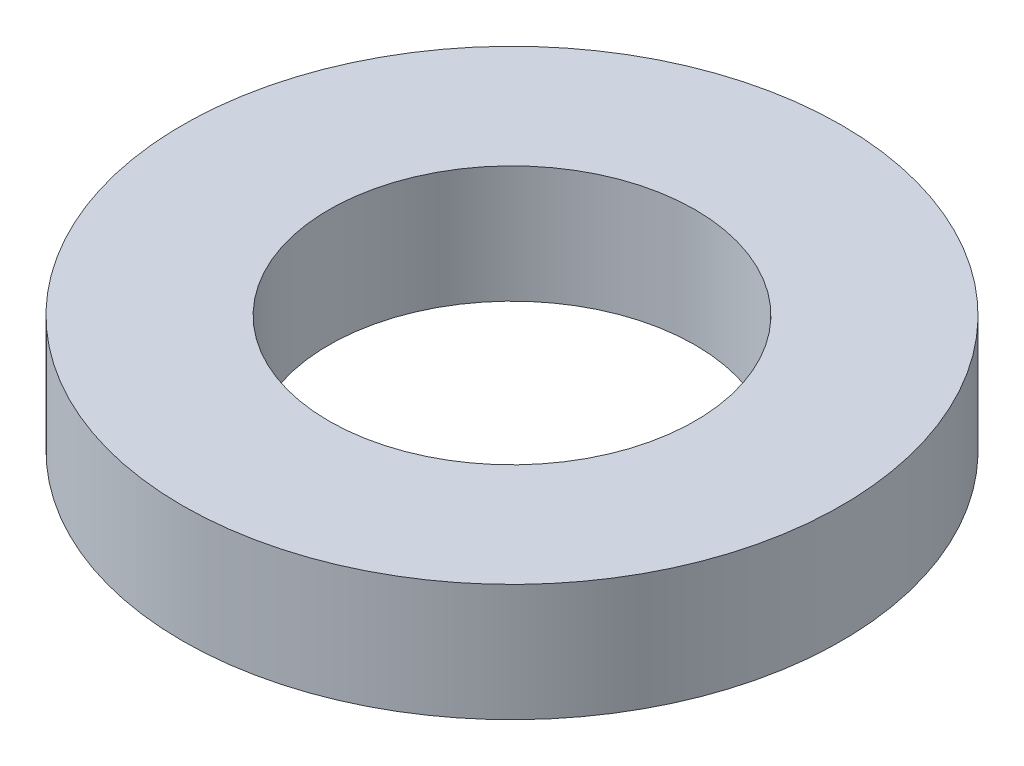
ISO-10303-21;
HEADER;
FILE_DESCRIPTION(('STEP AP214'),'2;1');
FILE_NAME('part.step','',(''),(''),'','','');
FILE_SCHEMA(('AUTOMOTIVE_DESIGN { 1 0 10303 214 1 1 1 1 }'));
ENDSEC;
DATA;
#1=APPLICATION_CONTEXT('core data for automotive mechanical design processes');
#2=APPLICATION_PROTOCOL_DEFINITION('international standard','automotive_design',2000,#1);
#3=PRODUCT_CONTEXT('',#1,'mechanical');
#4=PRODUCT('Part','Part','',(#3));
#5=PRODUCT_RELATED_PRODUCT_CATEGORY('part','',(#4));
#6=PRODUCT_DEFINITION_FORMATION('','',#4);
#7=PRODUCT_DEFINITION_CONTEXT('part definition',#1,'design');
#8=PRODUCT_DEFINITION('design','',#6,#7);
#9=PRODUCT_DEFINITION_SHAPE('','',#8);
#10=(LENGTH_UNIT() NAMED_UNIT(*) SI_UNIT(.MILLI.,.METRE.));
#11=(NAMED_UNIT(*) PLANE_ANGLE_UNIT() SI_UNIT($,.RADIAN.));
#12=(NAMED_UNIT(*) SI_UNIT($,.STERADIAN.) SOLID_ANGLE_UNIT());
#13=UNCERTAINTY_MEASURE_WITH_UNIT(LENGTH_MEASURE(1.E-05),#10,'distance_accuracy_value','');
#14=(GEOMETRIC_REPRESENTATION_CONTEXT(3) GLOBAL_UNCERTAINTY_ASSIGNED_CONTEXT((#13)) GLOBAL_UNIT_ASSIGNED_CONTEXT((#10,
#11,#12)) REPRESENTATION_CONTEXT('',''));
#15=CARTESIAN_POINT('',(0.,0.,0.));
#16=DIRECTION('',(0.,0.,1.));
#17=DIRECTION('',(1.,0.,0.));
#18=AXIS2_PLACEMENT_3D('',#15,#16,#17);
#19=CARTESIAN_POINT('',(0.,4.,0.));
#20=DIRECTION('',(0.,1.,0.));
#21=DIRECTION('',(0.,0.,1.));
#22=AXIS2_PLACEMENT_3D('',#19,#20,#21);
#23=PLANE('',#22);
#24=CARTESIAN_POINT('',(0.,4.,0.));
#25=DIRECTION('',(0.,1.,0.));
#26=DIRECTION('',(0.,0.,1.));
#27=AXIS2_PLACEMENT_3D('',#24,#25,#26);
#28=CIRCLE('',#27,22.5);
#29=CARTESIAN_POINT('',(0.,4.,22.5));
#30=VERTEX_POINT('',#29);
#31=EDGE_CURVE('E10',#30,#30,#28,.T.);
#32=ORIENTED_EDGE('',*,*,#31,.T.);
#33=EDGE_LOOP('',(#32));
#34=FACE_BOUND('',#33,.T.);
#35=CARTESIAN_POINT('',(0.,4.,0.));
#36=DIRECTION('',(0.,1.,0.));
#37=DIRECTION('',(0.,0.,1.));
#38=AXIS2_PLACEMENT_3D('',#35,#36,#37);
#39=CIRCLE('',#38,12.5);
#40=CARTESIAN_POINT('',(0.,4.,12.5));
#41=VERTEX_POINT('',#40);
#42=EDGE_CURVE('E50',#41,#41,#39,.T.);
#43=ORIENTED_EDGE('',*,*,#42,.F.);
#44=EDGE_LOOP('',(#43));
#45=FACE_BOUND('',#44,.T.);
#46=ADVANCED_FACE('F36',(#34,#45),#23,.T.);
#47=CARTESIAN_POINT('',(0.,-4.,0.));
#48=DIRECTION('',(0.,1.,0.));
#49=DIRECTION('',(0.,0.,1.));
#50=AXIS2_PLACEMENT_3D('',#47,#48,#49);
#51=PLANE('',#50);
#52=CARTESIAN_POINT('',(0.,-4.,0.));
#53=DIRECTION('',(0.,1.,0.));
#54=DIRECTION('',(0.,0.,1.));
#55=AXIS2_PLACEMENT_3D('',#52,#53,#54);
#56=CIRCLE('',#55,22.5);
#57=CARTESIAN_POINT('',(0.,-4.,22.5));
#58=VERTEX_POINT('',#57);
#59=EDGE_CURVE('E40',#58,#58,#56,.T.);
#60=ORIENTED_EDGE('',*,*,#59,.F.);
#61=EDGE_LOOP('',(#60));
#62=FACE_BOUND('',#61,.T.);
#63=CARTESIAN_POINT('',(0.,-4.,0.));
#64=DIRECTION('',(0.,1.,0.));
#65=DIRECTION('',(0.,0.,1.));
#66=AXIS2_PLACEMENT_3D('',#63,#64,#65);
#67=CIRCLE('',#66,12.5);
#68=CARTESIAN_POINT('',(0.,-4.,12.5));
#69=VERTEX_POINT('',#68);
#70=EDGE_CURVE('E52',#69,#69,#67,.T.);
#71=ORIENTED_EDGE('',*,*,#70,.T.);
#72=EDGE_LOOP('',(#71));
#73=FACE_BOUND('',#72,.T.);
#74=ADVANCED_FACE('F63',(#62,#73),#51,.F.);
#75=CARTESIAN_POINT('',(0.,4.,0.));
#76=DIRECTION('',(0.,-1.,0.));
#77=DIRECTION('',(0.,0.,-1.));
#78=AXIS2_PLACEMENT_3D('',#75,#76,#77);
#79=CYLINDRICAL_SURFACE('',#78,22.5);
#80=ORIENTED_EDGE('',*,*,#31,.F.);
#81=EDGE_LOOP('',(#80));
#82=FACE_BOUND('',#81,.T.);
#83=ORIENTED_EDGE('',*,*,#59,.T.);
#84=EDGE_LOOP('',(#83));
#85=FACE_BOUND('',#84,.T.);
#86=ADVANCED_FACE('F38',(#82,#85),#79,.T.);
#87=CARTESIAN_POINT('',(0.,4.,0.));
#88=DIRECTION('',(0.,-1.,0.));
#89=DIRECTION('',(0.,0.,-1.));
#90=AXIS2_PLACEMENT_3D('',#87,#88,#89);
#91=CYLINDRICAL_SURFACE('',#90,12.5);
#92=ORIENTED_EDGE('',*,*,#42,.T.);
#93=EDGE_LOOP('',(#92));
#94=FACE_BOUND('',#93,.T.);
#95=ORIENTED_EDGE('',*,*,#70,.F.);
#96=EDGE_LOOP('',(#95));
#97=FACE_BOUND('',#96,.T.);
#98=ADVANCED_FACE('F59',(#94,#97),#91,.F.);
#99=CLOSED_SHELL('',(#46,#74,#86,#98));
#100=MANIFOLD_SOLID_BREP('B2',#99);
#101=ADVANCED_BREP_SHAPE_REPRESENTATION('',(#18,#100),#14);
#102=SHAPE_DEFINITION_REPRESENTATION(#9,#101);
ENDSEC;
END-ISO-10303-21;
